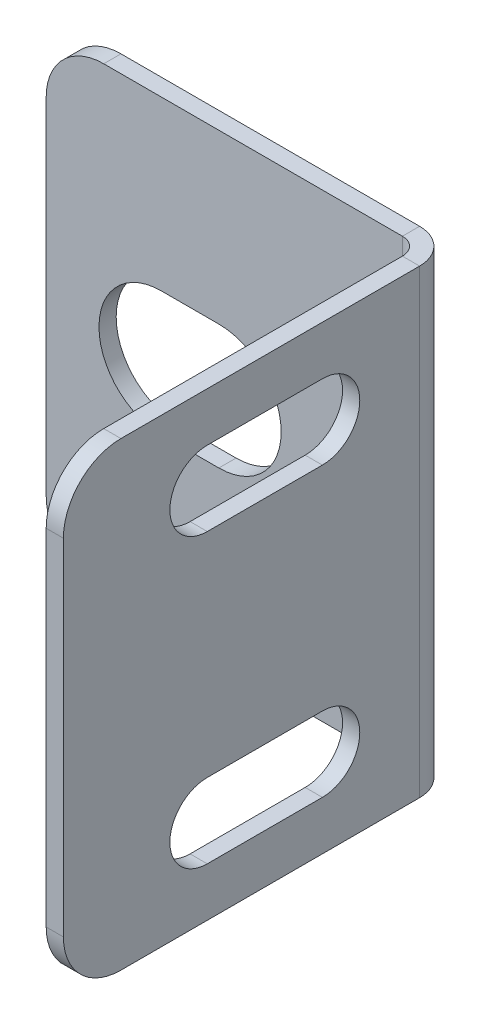
ISO-10303-21;
HEADER;
FILE_DESCRIPTION(('STEP AP214'),'2;1');
FILE_NAME('part.step','',(''),(''),'','','');
FILE_SCHEMA(('AUTOMOTIVE_DESIGN { 1 0 10303 214 1 1 1 1 }'));
ENDSEC;
DATA;
#1=APPLICATION_CONTEXT('core data for automotive mechanical design processes');
#2=APPLICATION_PROTOCOL_DEFINITION('international standard','automotive_design',2000,#1);
#3=PRODUCT_CONTEXT('',#1,'mechanical');
#4=PRODUCT('Part','Part','',(#3));
#5=PRODUCT_RELATED_PRODUCT_CATEGORY('part','',(#4));
#6=PRODUCT_DEFINITION_FORMATION('','',#4);
#7=PRODUCT_DEFINITION_CONTEXT('part definition',#1,'design');
#8=PRODUCT_DEFINITION('design','',#6,#7);
#9=PRODUCT_DEFINITION_SHAPE('','',#8);
#10=(LENGTH_UNIT() NAMED_UNIT(*) SI_UNIT(.MILLI.,.METRE.));
#11=(NAMED_UNIT(*) PLANE_ANGLE_UNIT() SI_UNIT($,.RADIAN.));
#12=(NAMED_UNIT(*) SI_UNIT($,.STERADIAN.) SOLID_ANGLE_UNIT());
#13=UNCERTAINTY_MEASURE_WITH_UNIT(LENGTH_MEASURE(1.E-05),#10,'distance_accuracy_value','');
#14=(GEOMETRIC_REPRESENTATION_CONTEXT(3) GLOBAL_UNCERTAINTY_ASSIGNED_CONTEXT((#13)) GLOBAL_UNIT_ASSIGNED_CONTEXT((#10,
#11,#12)) REPRESENTATION_CONTEXT('',''));
#15=CARTESIAN_POINT('',(0.,0.,0.));
#16=DIRECTION('',(0.,0.,1.));
#17=DIRECTION('',(1.,0.,0.));
#18=AXIS2_PLACEMENT_3D('',#15,#16,#17);
#19=CARTESIAN_POINT('',(-3.83615356006614,0.,4.54330643993387));
#20=DIRECTION('',(1.,0.,0.));
#21=DIRECTION('',(0.,0.,-1.));
#22=AXIS2_PLACEMENT_3D('',#19,#20,#21);
#23=PLANE('',#22);
#24=DIRECTION('',(0.,0.,1.));
#25=VECTOR('',#24,1.);
#26=CARTESIAN_POINT('',(-3.83615356006615,4.7,5.81330643993387));
#27=LINE('',#26,#25);
#28=CARTESIAN_POINT('',(-3.83615356006615,4.7,5.81330643993387));
#29=VERTEX_POINT('',#28);
#30=CARTESIAN_POINT('',(-3.83615356006616,4.7,10.8933064399339));
#31=VERTEX_POINT('',#30);
#32=EDGE_CURVE('E597',#29,#31,#27,.T.);
#33=ORIENTED_EDGE('',*,*,#32,.F.);
#34=CARTESIAN_POINT('',(-3.83615356006615,6.35,5.81330643993387));
#35=DIRECTION('',(-1.,0.,0.));
#36=DIRECTION('',(0.,0.,1.));
#37=AXIS2_PLACEMENT_3D('',#34,#35,#36);
#38=CIRCLE('',#37,1.65);
#39=CARTESIAN_POINT('',(-3.83615356006615,8.,5.81330643993387));
#40=VERTEX_POINT('',#39);
#41=EDGE_CURVE('E605',#40,#29,#38,.T.);
#42=ORIENTED_EDGE('',*,*,#41,.F.);
#43=DIRECTION('',(0.,0.,-1.));
#44=VECTOR('',#43,1.);
#45=CARTESIAN_POINT('',(-3.83615356006615,8.,5.81330643993387));
#46=LINE('',#45,#44);
#47=CARTESIAN_POINT('',(-3.83615356006616,8.,10.8933064399339));
#48=VERTEX_POINT('',#47);
#49=EDGE_CURVE('E736',#48,#40,#46,.T.);
#50=ORIENTED_EDGE('',*,*,#49,.F.);
#51=CARTESIAN_POINT('',(-3.83615356006616,6.35,10.8933064399339));
#52=DIRECTION('',(-1.,0.,0.));
#53=DIRECTION('',(0.,0.,1.));
#54=AXIS2_PLACEMENT_3D('',#51,#52,#53);
#55=CIRCLE('',#54,1.65);
#56=EDGE_CURVE('E512',#31,#48,#55,.T.);
#57=ORIENTED_EDGE('',*,*,#56,.F.);
#58=EDGE_LOOP('',(#33,#42,#50,#57));
#59=FACE_BOUND('',#58,.T.);
#60=DIRECTION('',(0.,0.,1.));
#61=VECTOR('',#60,1.);
#62=CARTESIAN_POINT('',(-3.83615356006614,-8.,5.81330643993386));
#63=LINE('',#62,#61);
#64=CARTESIAN_POINT('',(-3.83615356006614,-8.,5.81330643993386));
#65=VERTEX_POINT('',#64);
#66=CARTESIAN_POINT('',(-3.83615356006616,-8.,10.8933064399339));
#67=VERTEX_POINT('',#66);
#68=EDGE_CURVE('E538',#65,#67,#63,.T.);
#69=ORIENTED_EDGE('',*,*,#68,.F.);
#70=CARTESIAN_POINT('',(-3.83615356006614,-6.35,5.81330643993386));
#71=DIRECTION('',(-1.,0.,0.));
#72=DIRECTION('',(0.,0.,1.));
#73=AXIS2_PLACEMENT_3D('',#70,#71,#72);
#74=CIRCLE('',#73,1.65);
#75=CARTESIAN_POINT('',(-3.83615356006614,-4.7,5.81330643993387));
#76=VERTEX_POINT('',#75);
#77=EDGE_CURVE('E634',#76,#65,#74,.T.);
#78=ORIENTED_EDGE('',*,*,#77,.F.);
#79=DIRECTION('',(0.,0.,-1.));
#80=VECTOR('',#79,1.);
#81=CARTESIAN_POINT('',(-3.83615356006614,-4.7,5.81330643993387));
#82=LINE('',#81,#80);
#83=CARTESIAN_POINT('',(-3.83615356006616,-4.7,10.8933064399339));
#84=VERTEX_POINT('',#83);
#85=EDGE_CURVE('E598',#84,#76,#82,.T.);
#86=ORIENTED_EDGE('',*,*,#85,.F.);
#87=CARTESIAN_POINT('',(-3.83615356006616,-6.35,10.8933064399339));
#88=DIRECTION('',(-1.,0.,0.));
#89=DIRECTION('',(0.,0.,1.));
#90=AXIS2_PLACEMENT_3D('',#87,#88,#89);
#91=CIRCLE('',#90,1.65);
#92=EDGE_CURVE('E592',#67,#84,#91,.T.);
#93=ORIENTED_EDGE('',*,*,#92,.F.);
#94=EDGE_LOOP('',(#69,#78,#86,#93));
#95=FACE_BOUND('',#94,.T.);
#96=DIRECTION('',(0.,0.,-1.));
#97=VECTOR('',#96,1.);
#98=CARTESIAN_POINT('',(-3.83615356006619,10.16,17.2433064399339));
#99=LINE('',#98,#97);
#100=CARTESIAN_POINT('',(-3.83615356006618,10.16,14.7033064399339));
#101=VERTEX_POINT('',#100);
#102=CARTESIAN_POINT('',(-3.83615356006613,10.16,1.52146));
#103=VERTEX_POINT('',#102);
#104=EDGE_CURVE('E108',#101,#103,#99,.T.);
#105=ORIENTED_EDGE('',*,*,#104,.T.);
#106=DIRECTION('',(0.,-1.,0.));
#107=VECTOR('',#106,1.);
#108=CARTESIAN_POINT('',(-3.83615356006613,0.,1.52146));
#109=LINE('',#108,#107);
#110=CARTESIAN_POINT('',(-3.83615356006613,-10.16,1.52146));
#111=VERTEX_POINT('',#110);
#112=EDGE_CURVE('E340',#103,#111,#109,.T.);
#113=ORIENTED_EDGE('',*,*,#112,.T.);
#114=DIRECTION('',(0.,0.,1.));
#115=VECTOR('',#114,1.);
#116=CARTESIAN_POINT('',(-3.83615356006618,-10.16,17.2433064399339));
#117=LINE('',#116,#115);
#118=CARTESIAN_POINT('',(-3.83615356006618,-10.16,14.7033064399339));
#119=VERTEX_POINT('',#118);
#120=EDGE_CURVE('E505',#111,#119,#117,.T.);
#121=ORIENTED_EDGE('',*,*,#120,.T.);
#122=CARTESIAN_POINT('',(-3.83615356006618,-7.62,14.7033064399339));
#123=DIRECTION('',(1.,0.,0.));
#124=DIRECTION('',(0.,0.,-1.));
#125=AXIS2_PLACEMENT_3D('',#122,#123,#124);
#126=CIRCLE('',#125,2.54);
#127=CARTESIAN_POINT('',(-3.83615356006618,-7.62,17.2433064399339));
#128=VERTEX_POINT('',#127);
#129=EDGE_CURVE('E682',#119,#128,#126,.F.);
#130=ORIENTED_EDGE('',*,*,#129,.T.);
#131=DIRECTION('',(0.,1.,0.));
#132=VECTOR('',#131,1.);
#133=CARTESIAN_POINT('',(-3.83615356006619,10.16,17.2433064399339));
#134=LINE('',#133,#132);
#135=CARTESIAN_POINT('',(-3.83615356006619,7.62,17.2433064399339));
#136=VERTEX_POINT('',#135);
#137=EDGE_CURVE('E511',#128,#136,#134,.T.);
#138=ORIENTED_EDGE('',*,*,#137,.T.);
#139=CARTESIAN_POINT('',(-3.83615356006618,7.62,14.7033064399339));
#140=DIRECTION('',(1.,0.,0.));
#141=DIRECTION('',(0.,0.,-1.));
#142=AXIS2_PLACEMENT_3D('',#139,#140,#141);
#143=CIRCLE('',#142,2.54);
#144=EDGE_CURVE('E685',#136,#101,#143,.F.);
#145=ORIENTED_EDGE('',*,*,#144,.T.);
#146=EDGE_LOOP('',(#105,#113,#121,#130,#138,#145));
#147=FACE_BOUND('',#146,.T.);
#148=ADVANCED_FACE('F103',(#59,#95,#147),#23,.F.);
#149=CARTESIAN_POINT('',(-3.83615356006619,10.16,17.2433064399339));
#150=DIRECTION('',(0.,0.,-1.));
#151=DIRECTION('',(0.,1.,0.));
#152=AXIS2_PLACEMENT_3D('',#149,#150,#151);
#153=PLANE('',#152);
#154=DIRECTION('',(0.,1.,0.));
#155=VECTOR('',#154,1.);
#156=CARTESIAN_POINT('',(-3.07669356006619,0.,17.2433064399339));
#157=LINE('',#156,#155);
#158=CARTESIAN_POINT('',(-3.07669356006618,-7.62,17.2433064399339));
#159=VERTEX_POINT('',#158);
#160=CARTESIAN_POINT('',(-3.07669356006619,7.62,17.2433064399339));
#161=VERTEX_POINT('',#160);
#162=EDGE_CURVE('E539',#159,#161,#157,.T.);
#163=ORIENTED_EDGE('',*,*,#162,.T.);
#164=DIRECTION('',(1.,0.,0.));
#165=VECTOR('',#164,1.);
#166=CARTESIAN_POINT('',(-3.83615356006619,7.62,17.2433064399339));
#167=LINE('',#166,#165);
#168=EDGE_CURVE('E678',#161,#136,#167,.F.);
#169=ORIENTED_EDGE('',*,*,#168,.T.);
#170=ORIENTED_EDGE('',*,*,#137,.F.);
#171=DIRECTION('',(1.,0.,0.));
#172=VECTOR('',#171,1.);
#173=CARTESIAN_POINT('',(-3.83615356006618,-7.62,17.2433064399339));
#174=LINE('',#173,#172);
#175=EDGE_CURVE('E672',#128,#159,#174,.T.);
#176=ORIENTED_EDGE('',*,*,#175,.T.);
#177=EDGE_LOOP('',(#163,#169,#170,#176));
#178=FACE_BOUND('',#177,.T.);
#179=ADVANCED_FACE('F705',(#178),#153,.F.);
#180=CARTESIAN_POINT('',(-3.83615356006619,10.16,17.2433064399339));
#181=DIRECTION('',(0.,-1.,0.));
#182=DIRECTION('',(0.,0.,-1.));
#183=AXIS2_PLACEMENT_3D('',#180,#181,#182);
#184=PLANE('',#183);
#185=DIRECTION('',(1.,0.,0.));
#186=VECTOR('',#185,1.);
#187=CARTESIAN_POINT('',(-3.83615356006613,10.16,1.52146));
#188=LINE('',#187,#186);
#189=CARTESIAN_POINT('',(-3.07669356006613,10.16,1.52146000000001));
#190=VERTEX_POINT('',#189);
#191=EDGE_CURVE('E515',#103,#190,#188,.T.);
#192=ORIENTED_EDGE('',*,*,#191,.F.);
#193=ORIENTED_EDGE('',*,*,#104,.F.);
#194=DIRECTION('',(1.,0.,0.));
#195=VECTOR('',#194,1.);
#196=CARTESIAN_POINT('',(-3.83615356006618,10.16,14.7033064399339));
#197=LINE('',#196,#195);
#198=CARTESIAN_POINT('',(-3.07669356006618,10.16,14.7033064399339));
#199=VERTEX_POINT('',#198);
#200=EDGE_CURVE('E687',#101,#199,#197,.T.);
#201=ORIENTED_EDGE('',*,*,#200,.T.);
#202=DIRECTION('',(0.,0.,-1.));
#203=VECTOR('',#202,1.);
#204=CARTESIAN_POINT('',(-3.07669356006614,10.16,4.54330643993387));
#205=LINE('',#204,#203);
#206=EDGE_CURVE('E137',#199,#190,#205,.T.);
#207=ORIENTED_EDGE('',*,*,#206,.T.);
#208=EDGE_LOOP('',(#192,#193,#201,#207));
#209=FACE_BOUND('',#208,.T.);
#210=ADVANCED_FACE('F711',(#209),#184,.F.);
#211=CARTESIAN_POINT('',(-3.83615356006615,8.,5.81330643993387));
#212=DIRECTION('',(0.,-1.,0.));
#213=DIRECTION('',(0.,0.,-1.));
#214=AXIS2_PLACEMENT_3D('',#211,#212,#213);
#215=PLANE('',#214);
#216=DIRECTION('',(-1.,0.,0.));
#217=VECTOR('',#216,1.);
#218=CARTESIAN_POINT('',(-3.83615356006615,8.,5.81330643993387));
#219=LINE('',#218,#217);
#220=CARTESIAN_POINT('',(-3.07669356006615,8.,5.81330643993387));
#221=VERTEX_POINT('',#220);
#222=EDGE_CURVE('E667',#221,#40,#219,.T.);
#223=ORIENTED_EDGE('',*,*,#222,.F.);
#224=DIRECTION('',(0.,0.,-1.));
#225=VECTOR('',#224,1.);
#226=CARTESIAN_POINT('',(-3.07669356006614,8.,4.54330643993387));
#227=LINE('',#226,#225);
#228=CARTESIAN_POINT('',(-3.07669356006617,8.,10.8933064399339));
#229=VERTEX_POINT('',#228);
#230=EDGE_CURVE('E650',#229,#221,#227,.T.);
#231=ORIENTED_EDGE('',*,*,#230,.F.);
#232=DIRECTION('',(-1.,0.,0.));
#233=VECTOR('',#232,1.);
#234=CARTESIAN_POINT('',(-3.83615356006616,8.,10.8933064399339));
#235=LINE('',#234,#233);
#236=EDGE_CURVE('E661',#229,#48,#235,.T.);
#237=ORIENTED_EDGE('',*,*,#236,.T.);
#238=ORIENTED_EDGE('',*,*,#49,.T.);
#239=EDGE_LOOP('',(#223,#231,#237,#238));
#240=FACE_BOUND('',#239,.T.);
#241=ADVANCED_FACE('F743',(#240),#215,.T.);
#242=CARTESIAN_POINT('',(-3.83615356006616,6.35,10.8933064399339));
#243=DIRECTION('',(-1.,0.,0.));
#244=DIRECTION('',(0.,0.,1.));
#245=AXIS2_PLACEMENT_3D('',#242,#243,#244);
#246=CYLINDRICAL_SURFACE('',#245,1.65);
#247=ORIENTED_EDGE('',*,*,#236,.F.);
#248=CARTESIAN_POINT('',(-3.07669356006617,6.35,10.8933064399339));
#249=DIRECTION('',(-1.,0.,0.));
#250=DIRECTION('',(0.,0.,1.));
#251=AXIS2_PLACEMENT_3D('',#248,#249,#250);
#252=CIRCLE('',#251,1.65);
#253=CARTESIAN_POINT('',(-3.07669356006616,4.7,10.8933064399339));
#254=VERTEX_POINT('',#253);
#255=EDGE_CURVE('E645',#254,#229,#252,.T.);
#256=ORIENTED_EDGE('',*,*,#255,.F.);
#257=DIRECTION('',(-1.,0.,0.));
#258=VECTOR('',#257,1.);
#259=CARTESIAN_POINT('',(-3.83615356006616,4.7,10.8933064399339));
#260=LINE('',#259,#258);
#261=EDGE_CURVE('E657',#254,#31,#260,.T.);
#262=ORIENTED_EDGE('',*,*,#261,.T.);
#263=ORIENTED_EDGE('',*,*,#56,.T.);
#264=EDGE_LOOP('',(#247,#256,#262,#263));
#265=FACE_BOUND('',#264,.T.);
#266=ADVANCED_FACE('F744',(#265),#246,.F.);
#267=CARTESIAN_POINT('',(-3.83615356006615,4.7,5.81330643993387));
#268=DIRECTION('',(0.,1.,0.));
#269=DIRECTION('',(0.,0.,1.));
#270=AXIS2_PLACEMENT_3D('',#267,#268,#269);
#271=PLANE('',#270);
#272=ORIENTED_EDGE('',*,*,#261,.F.);
#273=DIRECTION('',(0.,0.,-1.));
#274=VECTOR('',#273,1.);
#275=CARTESIAN_POINT('',(-3.07669356006614,4.7,4.54330643993387));
#276=LINE('',#275,#274);
#277=CARTESIAN_POINT('',(-3.07669356006615,4.7,5.81330643993387));
#278=VERTEX_POINT('',#277);
#279=EDGE_CURVE('E581',#278,#254,#276,.F.);
#280=ORIENTED_EDGE('',*,*,#279,.F.);
#281=DIRECTION('',(-1.,0.,0.));
#282=VECTOR('',#281,1.);
#283=CARTESIAN_POINT('',(-3.83615356006615,4.7,5.81330643993387));
#284=LINE('',#283,#282);
#285=EDGE_CURVE('E662',#278,#29,#284,.T.);
#286=ORIENTED_EDGE('',*,*,#285,.T.);
#287=ORIENTED_EDGE('',*,*,#32,.T.);
#288=EDGE_LOOP('',(#272,#280,#286,#287));
#289=FACE_BOUND('',#288,.T.);
#290=ADVANCED_FACE('F729',(#289),#271,.T.);
#291=CARTESIAN_POINT('',(-3.83615356006614,-4.7,5.81330643993387));
#292=DIRECTION('',(0.,-1.,0.));
#293=DIRECTION('',(0.,0.,-1.));
#294=AXIS2_PLACEMENT_3D('',#291,#292,#293);
#295=PLANE('',#294);
#296=DIRECTION('',(-1.,0.,0.));
#297=VECTOR('',#296,1.);
#298=CARTESIAN_POINT('',(-3.83615356006614,-4.7,5.81330643993387));
#299=LINE('',#298,#297);
#300=CARTESIAN_POINT('',(-3.07669356006615,-4.7,5.81330643993387));
#301=VERTEX_POINT('',#300);
#302=EDGE_CURVE('E627',#301,#76,#299,.T.);
#303=ORIENTED_EDGE('',*,*,#302,.F.);
#304=DIRECTION('',(0.,0.,-1.));
#305=VECTOR('',#304,1.);
#306=CARTESIAN_POINT('',(-3.07669356006614,-4.7,4.54330643993387));
#307=LINE('',#306,#305);
#308=CARTESIAN_POINT('',(-3.07669356006616,-4.7,10.8933064399339));
#309=VERTEX_POINT('',#308);
#310=EDGE_CURVE('E572',#309,#301,#307,.T.);
#311=ORIENTED_EDGE('',*,*,#310,.F.);
#312=DIRECTION('',(-1.,0.,0.));
#313=VECTOR('',#312,1.);
#314=CARTESIAN_POINT('',(-3.83615356006616,-4.7,10.8933064399339));
#315=LINE('',#314,#313);
#316=EDGE_CURVE('E621',#309,#84,#315,.T.);
#317=ORIENTED_EDGE('',*,*,#316,.T.);
#318=ORIENTED_EDGE('',*,*,#85,.T.);
#319=EDGE_LOOP('',(#303,#311,#317,#318));
#320=FACE_BOUND('',#319,.T.);
#321=ADVANCED_FACE('F751',(#320),#295,.T.);
#322=CARTESIAN_POINT('',(-3.83615356006616,-6.35,10.8933064399339));
#323=DIRECTION('',(-1.,0.,0.));
#324=DIRECTION('',(0.,0.,1.));
#325=AXIS2_PLACEMENT_3D('',#322,#323,#324);
#326=CYLINDRICAL_SURFACE('',#325,1.65);
#327=ORIENTED_EDGE('',*,*,#316,.F.);
#328=CARTESIAN_POINT('',(-3.07669356006616,-6.35,10.8933064399339));
#329=DIRECTION('',(-1.,0.,0.));
#330=DIRECTION('',(0.,0.,1.));
#331=AXIS2_PLACEMENT_3D('',#328,#329,#330);
#332=CIRCLE('',#331,1.65);
#333=CARTESIAN_POINT('',(-3.07669356006616,-8.,10.8933064399339));
#334=VERTEX_POINT('',#333);
#335=EDGE_CURVE('E577',#334,#309,#332,.T.);
#336=ORIENTED_EDGE('',*,*,#335,.F.);
#337=DIRECTION('',(-1.,0.,0.));
#338=VECTOR('',#337,1.);
#339=CARTESIAN_POINT('',(-3.83615356006616,-8.,10.8933064399339));
#340=LINE('',#339,#338);
#341=EDGE_CURVE('E617',#334,#67,#340,.T.);
#342=ORIENTED_EDGE('',*,*,#341,.T.);
#343=ORIENTED_EDGE('',*,*,#92,.T.);
#344=EDGE_LOOP('',(#327,#336,#342,#343));
#345=FACE_BOUND('',#344,.T.);
#346=ADVANCED_FACE('F836',(#345),#326,.F.);
#347=CARTESIAN_POINT('',(-3.83615356006614,-8.,5.81330643993386));
#348=DIRECTION('',(0.,1.,0.));
#349=DIRECTION('',(0.,0.,1.));
#350=AXIS2_PLACEMENT_3D('',#347,#348,#349);
#351=PLANE('',#350);
#352=ORIENTED_EDGE('',*,*,#341,.F.);
#353=DIRECTION('',(0.,0.,-1.));
#354=VECTOR('',#353,1.);
#355=CARTESIAN_POINT('',(-3.07669356006614,-8.,4.54330643993387));
#356=LINE('',#355,#354);
#357=CARTESIAN_POINT('',(-3.07669356006614,-8.,5.81330643993387));
#358=VERTEX_POINT('',#357);
#359=EDGE_CURVE('E559',#358,#334,#356,.F.);
#360=ORIENTED_EDGE('',*,*,#359,.F.);
#361=DIRECTION('',(-1.,0.,0.));
#362=VECTOR('',#361,1.);
#363=CARTESIAN_POINT('',(-3.83615356006614,-8.,5.81330643993386));
#364=LINE('',#363,#362);
#365=EDGE_CURVE('E622',#358,#65,#364,.T.);
#366=ORIENTED_EDGE('',*,*,#365,.T.);
#367=ORIENTED_EDGE('',*,*,#68,.T.);
#368=EDGE_LOOP('',(#352,#360,#366,#367));
#369=FACE_BOUND('',#368,.T.);
#370=ADVANCED_FACE('F786',(#369),#351,.T.);
#371=CARTESIAN_POINT('',(-3.83615356006614,-6.35,5.81330643993386));
#372=DIRECTION('',(-1.,0.,0.));
#373=DIRECTION('',(0.,0.,1.));
#374=AXIS2_PLACEMENT_3D('',#371,#372,#373);
#375=CYLINDRICAL_SURFACE('',#374,1.65);
#376=CARTESIAN_POINT('',(-3.07669356006615,-6.35,5.81330643993387));
#377=DIRECTION('',(-1.,0.,0.));
#378=DIRECTION('',(0.,0.,1.));
#379=AXIS2_PLACEMENT_3D('',#376,#377,#378);
#380=CIRCLE('',#379,1.65);
#381=EDGE_CURVE('E562',#301,#358,#380,.T.);
#382=ORIENTED_EDGE('',*,*,#381,.F.);
#383=ORIENTED_EDGE('',*,*,#302,.T.);
#384=ORIENTED_EDGE('',*,*,#77,.T.);
#385=ORIENTED_EDGE('',*,*,#365,.F.);
#386=EDGE_LOOP('',(#382,#383,#384,#385));
#387=FACE_BOUND('',#386,.T.);
#388=ADVANCED_FACE('F781',(#387),#375,.F.);
#389=CARTESIAN_POINT('',(-3.83615356006615,6.35,5.81330643993387));
#390=DIRECTION('',(-1.,0.,0.));
#391=DIRECTION('',(0.,0.,1.));
#392=AXIS2_PLACEMENT_3D('',#389,#390,#391);
#393=CYLINDRICAL_SURFACE('',#392,1.65);
#394=CARTESIAN_POINT('',(-3.07669356006615,6.35,5.81330643993387));
#395=DIRECTION('',(-1.,0.,0.));
#396=DIRECTION('',(0.,0.,1.));
#397=AXIS2_PLACEMENT_3D('',#394,#395,#396);
#398=CIRCLE('',#397,1.65);
#399=EDGE_CURVE('E644',#221,#278,#398,.T.);
#400=ORIENTED_EDGE('',*,*,#399,.F.);
#401=ORIENTED_EDGE('',*,*,#222,.T.);
#402=ORIENTED_EDGE('',*,*,#41,.T.);
#403=ORIENTED_EDGE('',*,*,#285,.F.);
#404=EDGE_LOOP('',(#400,#401,#402,#403));
#405=FACE_BOUND('',#404,.T.);
#406=ADVANCED_FACE('F724',(#405),#393,.F.);
#407=CARTESIAN_POINT('',(-3.83615356006618,-10.16,17.2433064399339));
#408=DIRECTION('',(0.,1.,0.));
#409=DIRECTION('',(0.,0.,1.));
#410=AXIS2_PLACEMENT_3D('',#407,#408,#409);
#411=PLANE('',#410);
#412=DIRECTION('',(-1.,0.,0.));
#413=VECTOR('',#412,1.);
#414=CARTESIAN_POINT('',(-3.83615356006613,-10.16,1.52146));
#415=LINE('',#414,#413);
#416=CARTESIAN_POINT('',(-3.07669356006613,-10.16,1.52146));
#417=VERTEX_POINT('',#416);
#418=EDGE_CURVE('E13',#417,#111,#415,.T.);
#419=ORIENTED_EDGE('',*,*,#418,.F.);
#420=DIRECTION('',(0.,0.,-1.));
#421=VECTOR('',#420,1.);
#422=CARTESIAN_POINT('',(-3.07669356006614,-10.16,4.54330643993387));
#423=LINE('',#422,#421);
#424=CARTESIAN_POINT('',(-3.07669356006618,-10.16,14.7033064399339));
#425=VERTEX_POINT('',#424);
#426=EDGE_CURVE('E126',#417,#425,#423,.F.);
#427=ORIENTED_EDGE('',*,*,#426,.T.);
#428=DIRECTION('',(1.,0.,0.));
#429=VECTOR('',#428,1.);
#430=CARTESIAN_POINT('',(-3.83615356006618,-10.16,14.7033064399339));
#431=LINE('',#430,#429);
#432=EDGE_CURVE('E507',#425,#119,#431,.F.);
#433=ORIENTED_EDGE('',*,*,#432,.T.);
#434=ORIENTED_EDGE('',*,*,#120,.F.);
#435=EDGE_LOOP('',(#419,#427,#433,#434));
#436=FACE_BOUND('',#435,.T.);
#437=ADVANCED_FACE('F106',(#436),#411,.F.);
#438=CARTESIAN_POINT('',(-3.07669356006614,0.,4.54330643993387));
#439=DIRECTION('',(1.,0.,0.));
#440=DIRECTION('',(0.,0.,-1.));
#441=AXIS2_PLACEMENT_3D('',#438,#439,#440);
#442=PLANE('',#441);
#443=DIRECTION('',(0.,-1.,0.));
#444=VECTOR('',#443,1.);
#445=CARTESIAN_POINT('',(-3.07669356006613,0.,1.52146));
#446=LINE('',#445,#444);
#447=EDGE_CURVE('E115',#190,#417,#446,.T.);
#448=ORIENTED_EDGE('',*,*,#447,.F.);
#449=ORIENTED_EDGE('',*,*,#206,.F.);
#450=CARTESIAN_POINT('',(-3.07669356006618,7.62,14.7033064399339));
#451=DIRECTION('',(1.,0.,0.));
#452=DIRECTION('',(0.,0.,-1.));
#453=AXIS2_PLACEMENT_3D('',#450,#451,#452);
#454=CIRCLE('',#453,2.54);
#455=EDGE_CURVE('E520',#199,#161,#454,.T.);
#456=ORIENTED_EDGE('',*,*,#455,.T.);
#457=ORIENTED_EDGE('',*,*,#162,.F.);
#458=CARTESIAN_POINT('',(-3.07669356006618,-7.62,14.7033064399339));
#459=DIRECTION('',(1.,0.,0.));
#460=DIRECTION('',(0.,0.,-1.));
#461=AXIS2_PLACEMENT_3D('',#458,#459,#460);
#462=CIRCLE('',#461,2.54);
#463=EDGE_CURVE('E691',#159,#425,#462,.T.);
#464=ORIENTED_EDGE('',*,*,#463,.T.);
#465=ORIENTED_EDGE('',*,*,#426,.F.);
#466=EDGE_LOOP('',(#448,#449,#456,#457,#464,#465));
#467=FACE_BOUND('',#466,.T.);
#468=ORIENTED_EDGE('',*,*,#359,.T.);
#469=ORIENTED_EDGE('',*,*,#335,.T.);
#470=ORIENTED_EDGE('',*,*,#310,.T.);
#471=ORIENTED_EDGE('',*,*,#381,.T.);
#472=EDGE_LOOP('',(#468,#469,#470,#471));
#473=FACE_BOUND('',#472,.T.);
#474=ORIENTED_EDGE('',*,*,#279,.T.);
#475=ORIENTED_EDGE('',*,*,#255,.T.);
#476=ORIENTED_EDGE('',*,*,#230,.T.);
#477=ORIENTED_EDGE('',*,*,#399,.T.);
#478=EDGE_LOOP('',(#474,#475,#476,#477));
#479=FACE_BOUND('',#478,.T.);
#480=ADVANCED_FACE('F699',(#467,#473,#479),#442,.T.);
#481=CARTESIAN_POINT('',(-3.83615356006618,7.62,14.7033064399339));
#482=DIRECTION('',(-1.,0.,0.));
#483=DIRECTION('',(0.,0.,1.));
#484=AXIS2_PLACEMENT_3D('',#481,#482,#483);
#485=CYLINDRICAL_SURFACE('',#484,2.54);
#486=ORIENTED_EDGE('',*,*,#455,.F.);
#487=ORIENTED_EDGE('',*,*,#200,.F.);
#488=ORIENTED_EDGE('',*,*,#144,.F.);
#489=ORIENTED_EDGE('',*,*,#168,.F.);
#490=EDGE_LOOP('',(#486,#487,#488,#489));
#491=FACE_BOUND('',#490,.T.);
#492=ADVANCED_FACE('F710',(#491),#485,.T.);
#493=CARTESIAN_POINT('',(-3.83615356006618,-7.62,14.7033064399339));
#494=DIRECTION('',(-1.,0.,0.));
#495=DIRECTION('',(0.,0.,1.));
#496=AXIS2_PLACEMENT_3D('',#493,#494,#495);
#497=CYLINDRICAL_SURFACE('',#496,2.54);
#498=ORIENTED_EDGE('',*,*,#463,.F.);
#499=ORIENTED_EDGE('',*,*,#175,.F.);
#500=ORIENTED_EDGE('',*,*,#129,.F.);
#501=ORIENTED_EDGE('',*,*,#432,.F.);
#502=EDGE_LOOP('',(#498,#499,#500,#501));
#503=FACE_BOUND('',#502,.T.);
#504=ADVANCED_FACE('F767',(#503),#497,.T.);
#505=CARTESIAN_POINT('',(-12.7,0.,0.75946));
#506=DIRECTION('',(0.,0.,1.));
#507=DIRECTION('',(1.,0.,0.));
#508=AXIS2_PLACEMENT_3D('',#505,#506,#507);
#509=CYLINDRICAL_SURFACE('',#508,2.75);
#510=DIRECTION('',(0.,0.,1.));
#511=VECTOR('',#510,1.);
#512=CARTESIAN_POINT('',(-12.7,2.75,0.75946));
#513=LINE('',#512,#511);
#514=CARTESIAN_POINT('',(-12.7,2.75,0.));
#515=VERTEX_POINT('',#514);
#516=CARTESIAN_POINT('',(-12.7,2.75,0.75946));
#517=VERTEX_POINT('',#516);
#518=EDGE_CURVE('E448',#515,#517,#513,.T.);
#519=ORIENTED_EDGE('',*,*,#518,.F.);
#520=CARTESIAN_POINT('',(-12.7,0.,0.));
#521=DIRECTION('',(0.,0.,1.));
#522=DIRECTION('',(1.,0.,0.));
#523=AXIS2_PLACEMENT_3D('',#520,#521,#522);
#524=CIRCLE('',#523,2.75);
#525=CARTESIAN_POINT('',(-12.7,-2.75,0.));
#526=VERTEX_POINT('',#525);
#527=EDGE_CURVE('E432',#526,#515,#524,.T.);
#528=ORIENTED_EDGE('',*,*,#527,.F.);
#529=DIRECTION('',(0.,0.,1.));
#530=VECTOR('',#529,1.);
#531=CARTESIAN_POINT('',(-12.7,-2.75,0.75946));
#532=LINE('',#531,#530);
#533=CARTESIAN_POINT('',(-12.7,-2.75,0.75946));
#534=VERTEX_POINT('',#533);
#535=EDGE_CURVE('E354',#526,#534,#532,.T.);
#536=ORIENTED_EDGE('',*,*,#535,.T.);
#537=CARTESIAN_POINT('',(-12.7,0.,0.75946));
#538=DIRECTION('',(0.,0.,1.));
#539=DIRECTION('',(1.,0.,0.));
#540=AXIS2_PLACEMENT_3D('',#537,#538,#539);
#541=CIRCLE('',#540,2.75);
#542=EDGE_CURVE('E455',#534,#517,#541,.T.);
#543=ORIENTED_EDGE('',*,*,#542,.T.);
#544=EDGE_LOOP('',(#519,#528,#536,#543));
#545=FACE_BOUND('',#544,.T.);
#546=ADVANCED_FACE('F814',(#545),#509,.F.);
#547=CARTESIAN_POINT('',(-15.24,2.75,0.75946));
#548=DIRECTION('',(0.,-1.,0.));
#549=DIRECTION('',(-1.,0.,0.));
#550=AXIS2_PLACEMENT_3D('',#547,#548,#549);
#551=PLANE('',#550);
#552=DIRECTION('',(0.,0.,1.));
#553=VECTOR('',#552,1.);
#554=CARTESIAN_POINT('',(-15.24,2.75,0.75946));
#555=LINE('',#554,#553);
#556=CARTESIAN_POINT('',(-15.24,2.75,0.));
#557=VERTEX_POINT('',#556);
#558=CARTESIAN_POINT('',(-15.24,2.75,0.75946));
#559=VERTEX_POINT('',#558);
#560=EDGE_CURVE('E439',#557,#559,#555,.T.);
#561=ORIENTED_EDGE('',*,*,#560,.F.);
#562=DIRECTION('',(-1.,0.,0.));
#563=VECTOR('',#562,1.);
#564=CARTESIAN_POINT('',(0.,2.75,0.));
#565=LINE('',#564,#563);
#566=EDGE_CURVE('E425',#515,#557,#565,.T.);
#567=ORIENTED_EDGE('',*,*,#566,.F.);
#568=ORIENTED_EDGE('',*,*,#518,.T.);
#569=DIRECTION('',(-1.,0.,0.));
#570=VECTOR('',#569,1.);
#571=CARTESIAN_POINT('',(-15.24,2.75,0.75946));
#572=LINE('',#571,#570);
#573=EDGE_CURVE('E443',#517,#559,#572,.T.);
#574=ORIENTED_EDGE('',*,*,#573,.T.);
#575=EDGE_LOOP('',(#561,#567,#568,#574));
#576=FACE_BOUND('',#575,.T.);
#577=ADVANCED_FACE('F819',(#576),#551,.T.);
#578=CARTESIAN_POINT('',(-15.24,0.,0.75946));
#579=DIRECTION('',(0.,0.,1.));
#580=DIRECTION('',(1.,0.,0.));
#581=AXIS2_PLACEMENT_3D('',#578,#579,#580);
#582=CYLINDRICAL_SURFACE('',#581,2.75);
#583=CARTESIAN_POINT('',(-15.24,0.,0.));
#584=DIRECTION('',(0.,0.,1.));
#585=DIRECTION('',(1.,0.,0.));
#586=AXIS2_PLACEMENT_3D('',#583,#584,#585);
#587=CIRCLE('',#586,2.75);
#588=CARTESIAN_POINT('',(-15.24,-2.75,0.));
#589=VERTEX_POINT('',#588);
#590=EDGE_CURVE('E418',#557,#589,#587,.T.);
#591=ORIENTED_EDGE('',*,*,#590,.F.);
#592=ORIENTED_EDGE('',*,*,#560,.T.);
#593=CARTESIAN_POINT('',(-15.24,0.,0.75946));
#594=DIRECTION('',(0.,0.,1.));
#595=DIRECTION('',(1.,0.,0.));
#596=AXIS2_PLACEMENT_3D('',#593,#594,#595);
#597=CIRCLE('',#596,2.75);
#598=CARTESIAN_POINT('',(-15.24,-2.75,0.75946));
#599=VERTEX_POINT('',#598);
#600=EDGE_CURVE('E409',#559,#599,#597,.T.);
#601=ORIENTED_EDGE('',*,*,#600,.T.);
#602=DIRECTION('',(0.,0.,1.));
#603=VECTOR('',#602,1.);
#604=CARTESIAN_POINT('',(-15.24,-2.75,0.75946));
#605=LINE('',#604,#603);
#606=EDGE_CURVE('E406',#589,#599,#605,.T.);
#607=ORIENTED_EDGE('',*,*,#606,.F.);
#608=EDGE_LOOP('',(#591,#592,#601,#607));
#609=FACE_BOUND('',#608,.T.);
#610=ADVANCED_FACE('F828',(#609),#582,.F.);
#611=CARTESIAN_POINT('',(-15.24,-2.75,0.75946));
#612=DIRECTION('',(0.,1.,0.));
#613=DIRECTION('',(1.,0.,0.));
#614=AXIS2_PLACEMENT_3D('',#611,#612,#613);
#615=PLANE('',#614);
#616=ORIENTED_EDGE('',*,*,#535,.F.);
#617=DIRECTION('',(-1.,0.,0.));
#618=VECTOR('',#617,1.);
#619=CARTESIAN_POINT('',(0.,-2.75,0.));
#620=LINE('',#619,#618);
#621=EDGE_CURVE('E859',#589,#526,#620,.F.);
#622=ORIENTED_EDGE('',*,*,#621,.F.);
#623=ORIENTED_EDGE('',*,*,#606,.T.);
#624=DIRECTION('',(1.,0.,0.));
#625=VECTOR('',#624,1.);
#626=CARTESIAN_POINT('',(-15.24,-2.75,0.75946));
#627=LINE('',#626,#625);
#628=EDGE_CURVE('E399',#599,#534,#627,.T.);
#629=ORIENTED_EDGE('',*,*,#628,.T.);
#630=EDGE_LOOP('',(#616,#622,#623,#629));
#631=FACE_BOUND('',#630,.T.);
#632=ADVANCED_FACE('F823',(#631),#615,.T.);
#633=CARTESIAN_POINT('',(-17.78,-7.62,0.75946));
#634=DIRECTION('',(0.,0.,1.));
#635=DIRECTION('',(1.,0.,0.));
#636=AXIS2_PLACEMENT_3D('',#633,#634,#635);
#637=CYLINDRICAL_SURFACE('',#636,2.54);
#638=CARTESIAN_POINT('',(-17.78,-7.62,0.));
#639=DIRECTION('',(0.,0.,-1.));
#640=DIRECTION('',(-1.,0.,0.));
#641=AXIS2_PLACEMENT_3D('',#638,#639,#640);
#642=CIRCLE('',#641,2.54);
#643=CARTESIAN_POINT('',(-17.78,-10.16,0.));
#644=VERTEX_POINT('',#643);
#645=CARTESIAN_POINT('',(-20.32,-7.62,0.));
#646=VERTEX_POINT('',#645);
#647=EDGE_CURVE('E484',#644,#646,#642,.T.);
#648=ORIENTED_EDGE('',*,*,#647,.F.);
#649=DIRECTION('',(0.,0.,-1.));
#650=VECTOR('',#649,1.);
#651=CARTESIAN_POINT('',(-17.78,-10.16,0.75946));
#652=LINE('',#651,#650);
#653=CARTESIAN_POINT('',(-17.78,-10.16,0.75946));
#654=VERTEX_POINT('',#653);
#655=EDGE_CURVE('E474',#654,#644,#652,.T.);
#656=ORIENTED_EDGE('',*,*,#655,.F.);
#657=CARTESIAN_POINT('',(-17.78,-7.62,0.75946));
#658=DIRECTION('',(0.,0.,-1.));
#659=DIRECTION('',(-1.,0.,0.));
#660=AXIS2_PLACEMENT_3D('',#657,#658,#659);
#661=CIRCLE('',#660,2.54);
#662=CARTESIAN_POINT('',(-20.32,-7.62,0.75946));
#663=VERTEX_POINT('',#662);
#664=EDGE_CURVE('E390',#663,#654,#661,.F.);
#665=ORIENTED_EDGE('',*,*,#664,.F.);
#666=DIRECTION('',(0.,0.,-1.));
#667=VECTOR('',#666,1.);
#668=CARTESIAN_POINT('',(-20.32,-7.62,0.75946));
#669=LINE('',#668,#667);
#670=EDGE_CURVE('E369',#646,#663,#669,.F.);
#671=ORIENTED_EDGE('',*,*,#670,.F.);
#672=EDGE_LOOP('',(#648,#656,#665,#671));
#673=FACE_BOUND('',#672,.T.);
#674=ADVANCED_FACE('F557',(#673),#637,.T.);
#675=CARTESIAN_POINT('',(-20.32,10.16,0.75946));
#676=DIRECTION('',(1.,0.,0.));
#677=DIRECTION('',(0.,-1.,0.));
#678=AXIS2_PLACEMENT_3D('',#675,#676,#677);
#679=PLANE('',#678);
#680=DIRECTION('',(0.,1.,0.));
#681=VECTOR('',#680,1.);
#682=CARTESIAN_POINT('',(-20.32,0.,0.));
#683=LINE('',#682,#681);
#684=CARTESIAN_POINT('',(-20.32,7.62,0.));
#685=VERTEX_POINT('',#684);
#686=EDGE_CURVE('E405',#685,#646,#683,.F.);
#687=ORIENTED_EDGE('',*,*,#686,.T.);
#688=ORIENTED_EDGE('',*,*,#670,.T.);
#689=DIRECTION('',(0.,-1.,0.));
#690=VECTOR('',#689,1.);
#691=CARTESIAN_POINT('',(-20.32,10.16,0.75946));
#692=LINE('',#691,#690);
#693=CARTESIAN_POINT('',(-20.32,7.62,0.75946));
#694=VERTEX_POINT('',#693);
#695=EDGE_CURVE('E366',#694,#663,#692,.T.);
#696=ORIENTED_EDGE('',*,*,#695,.F.);
#697=DIRECTION('',(0.,0.,-1.));
#698=VECTOR('',#697,1.);
#699=CARTESIAN_POINT('',(-20.32,7.62,0.75946));
#700=LINE('',#699,#698);
#701=EDGE_CURVE('E362',#694,#685,#700,.T.);
#702=ORIENTED_EDGE('',*,*,#701,.T.);
#703=EDGE_LOOP('',(#687,#688,#696,#702));
#704=FACE_BOUND('',#703,.T.);
#705=ADVANCED_FACE('F843',(#704),#679,.F.);
#706=CARTESIAN_POINT('',(-17.78,7.62,0.75946));
#707=DIRECTION('',(0.,0.,1.));
#708=DIRECTION('',(1.,0.,0.));
#709=AXIS2_PLACEMENT_3D('',#706,#707,#708);
#710=CYLINDRICAL_SURFACE('',#709,2.54);
#711=CARTESIAN_POINT('',(-17.78,7.62,0.));
#712=DIRECTION('',(0.,0.,-1.));
#713=DIRECTION('',(-1.,0.,0.));
#714=AXIS2_PLACEMENT_3D('',#711,#712,#713);
#715=CIRCLE('',#714,2.54);
#716=CARTESIAN_POINT('',(-17.78,10.16,0.));
#717=VERTEX_POINT('',#716);
#718=EDGE_CURVE('E480',#685,#717,#715,.T.);
#719=ORIENTED_EDGE('',*,*,#718,.F.);
#720=ORIENTED_EDGE('',*,*,#701,.F.);
#721=CARTESIAN_POINT('',(-17.78,7.62,0.75946));
#722=DIRECTION('',(0.,0.,-1.));
#723=DIRECTION('',(-1.,0.,0.));
#724=AXIS2_PLACEMENT_3D('',#721,#722,#723);
#725=CIRCLE('',#724,2.54);
#726=CARTESIAN_POINT('',(-17.78,10.16,0.75946));
#727=VERTEX_POINT('',#726);
#728=EDGE_CURVE('E361',#727,#694,#725,.F.);
#729=ORIENTED_EDGE('',*,*,#728,.F.);
#730=DIRECTION('',(0.,0.,-1.));
#731=VECTOR('',#730,1.);
#732=CARTESIAN_POINT('',(-17.78,10.16,0.75946));
#733=LINE('',#732,#731);
#734=EDGE_CURVE('E359',#717,#727,#733,.F.);
#735=ORIENTED_EDGE('',*,*,#734,.F.);
#736=EDGE_LOOP('',(#719,#720,#729,#735));
#737=FACE_BOUND('',#736,.T.);
#738=ADVANCED_FACE('F817',(#737),#710,.T.);
#739=CARTESIAN_POINT('',(0.,0.,0.75946));
#740=DIRECTION('',(0.,0.,-1.));
#741=DIRECTION('',(-1.,0.,0.));
#742=AXIS2_PLACEMENT_3D('',#739,#740,#741);
#743=PLANE('',#742);
#744=DIRECTION('',(0.,-1.,0.));
#745=VECTOR('',#744,1.);
#746=CARTESIAN_POINT('',(-4.59815356006613,0.,0.75946));
#747=LINE('',#746,#745);
#748=CARTESIAN_POINT('',(-4.59815356006613,10.16,0.75946));
#749=VERTEX_POINT('',#748);
#750=CARTESIAN_POINT('',(-4.59815356006613,-10.16,0.75946));
#751=VERTEX_POINT('',#750);
#752=EDGE_CURVE('E337',#749,#751,#747,.T.);
#753=ORIENTED_EDGE('',*,*,#752,.F.);
#754=DIRECTION('',(-1.,0.,0.));
#755=VECTOR('',#754,1.);
#756=CARTESIAN_POINT('',(12.7,10.16,0.75946));
#757=LINE('',#756,#755);
#758=EDGE_CURVE('E349',#749,#727,#757,.T.);
#759=ORIENTED_EDGE('',*,*,#758,.T.);
#760=ORIENTED_EDGE('',*,*,#728,.T.);
#761=ORIENTED_EDGE('',*,*,#695,.T.);
#762=ORIENTED_EDGE('',*,*,#664,.T.);
#763=DIRECTION('',(1.,0.,0.));
#764=VECTOR('',#763,1.);
#765=CARTESIAN_POINT('',(12.7,-10.16,0.75946));
#766=LINE('',#765,#764);
#767=EDGE_CURVE('E331',#654,#751,#766,.T.);
#768=ORIENTED_EDGE('',*,*,#767,.T.);
#769=EDGE_LOOP('',(#753,#759,#760,#761,#762,#768));
#770=FACE_BOUND('',#769,.T.);
#771=ORIENTED_EDGE('',*,*,#628,.F.);
#772=ORIENTED_EDGE('',*,*,#600,.F.);
#773=ORIENTED_EDGE('',*,*,#573,.F.);
#774=ORIENTED_EDGE('',*,*,#542,.F.);
#775=EDGE_LOOP('',(#771,#772,#773,#774));
#776=FACE_BOUND('',#775,.T.);
#777=ADVANCED_FACE('F347',(#770,#776),#743,.F.);
#778=CARTESIAN_POINT('',(12.7,10.16,0.75946));
#779=DIRECTION('',(0.,-1.,0.));
#780=DIRECTION('',(-1.,0.,0.));
#781=AXIS2_PLACEMENT_3D('',#778,#779,#780);
#782=PLANE('',#781);
#783=ORIENTED_EDGE('',*,*,#758,.F.);
#784=DIRECTION('',(0.,0.,-1.));
#785=VECTOR('',#784,1.);
#786=CARTESIAN_POINT('',(-4.59815356006614,10.16,0.75946));
#787=LINE('',#786,#785);
#788=CARTESIAN_POINT('',(-4.59815356006614,10.16,0.));
#789=VERTEX_POINT('',#788);
#790=EDGE_CURVE('E318',#749,#789,#787,.T.);
#791=ORIENTED_EDGE('',*,*,#790,.T.);
#792=DIRECTION('',(-1.,0.,0.));
#793=VECTOR('',#792,1.);
#794=CARTESIAN_POINT('',(0.,10.16,0.));
#795=LINE('',#794,#793);
#796=EDGE_CURVE('E330',#789,#717,#795,.T.);
#797=ORIENTED_EDGE('',*,*,#796,.T.);
#798=ORIENTED_EDGE('',*,*,#734,.T.);
#799=EDGE_LOOP('',(#783,#791,#797,#798));
#800=FACE_BOUND('',#799,.T.);
#801=ADVANCED_FACE('F357',(#800),#782,.F.);
#802=CARTESIAN_POINT('',(0.,0.,0.));
#803=DIRECTION('',(0.,0.,-1.));
#804=DIRECTION('',(-1.,0.,0.));
#805=AXIS2_PLACEMENT_3D('',#802,#803,#804);
#806=PLANE('',#805);
#807=ORIENTED_EDGE('',*,*,#621,.T.);
#808=ORIENTED_EDGE('',*,*,#527,.T.);
#809=ORIENTED_EDGE('',*,*,#566,.T.);
#810=ORIENTED_EDGE('',*,*,#590,.T.);
#811=EDGE_LOOP('',(#807,#808,#809,#810));
#812=FACE_BOUND('',#811,.T.);
#813=ORIENTED_EDGE('',*,*,#796,.F.);
#814=DIRECTION('',(0.,-1.,0.));
#815=VECTOR('',#814,1.);
#816=CARTESIAN_POINT('',(-4.59815356006613,0.,0.));
#817=LINE('',#816,#815);
#818=CARTESIAN_POINT('',(-4.59815356006613,-10.16,0.));
#819=VERTEX_POINT('',#818);
#820=EDGE_CURVE('E424',#789,#819,#817,.T.);
#821=ORIENTED_EDGE('',*,*,#820,.T.);
#822=DIRECTION('',(-1.,0.,0.));
#823=VECTOR('',#822,1.);
#824=CARTESIAN_POINT('',(0.,-10.16,0.));
#825=LINE('',#824,#823);
#826=EDGE_CURVE('E475',#644,#819,#825,.F.);
#827=ORIENTED_EDGE('',*,*,#826,.F.);
#828=ORIENTED_EDGE('',*,*,#647,.T.);
#829=ORIENTED_EDGE('',*,*,#686,.F.);
#830=ORIENTED_EDGE('',*,*,#718,.T.);
#831=EDGE_LOOP('',(#813,#821,#827,#828,#829,#830));
#832=FACE_BOUND('',#831,.T.);
#833=ADVANCED_FACE('F826',(#812,#832),#806,.T.);
#834=CARTESIAN_POINT('',(12.7,-10.16,0.75946));
#835=DIRECTION('',(0.,1.,0.));
#836=DIRECTION('',(1.,0.,0.));
#837=AXIS2_PLACEMENT_3D('',#834,#835,#836);
#838=PLANE('',#837);
#839=ORIENTED_EDGE('',*,*,#826,.T.);
#840=DIRECTION('',(0.,0.,1.));
#841=VECTOR('',#840,1.);
#842=CARTESIAN_POINT('',(-4.59815356006613,-10.16,0.75946));
#843=LINE('',#842,#841);
#844=EDGE_CURVE('E469',#819,#751,#843,.T.);
#845=ORIENTED_EDGE('',*,*,#844,.T.);
#846=ORIENTED_EDGE('',*,*,#767,.F.);
#847=ORIENTED_EDGE('',*,*,#655,.T.);
#848=EDGE_LOOP('',(#839,#845,#846,#847));
#849=FACE_BOUND('',#848,.T.);
#850=ADVANCED_FACE('F554',(#849),#838,.F.);
#851=CARTESIAN_POINT('',(-4.59815356006613,10.16,1.52146));
#852=DIRECTION('',(0.,-1.,0.));
#853=DIRECTION('',(0.,0.,-1.));
#854=AXIS2_PLACEMENT_3D('',#851,#852,#853);
#855=PLANE('',#854);
#856=ORIENTED_EDGE('',*,*,#191,.T.);
#857=CARTESIAN_POINT('',(-4.59815356006613,10.16,1.52146));
#858=DIRECTION('',(0.,1.,0.));
#859=DIRECTION('',(-1.,0.,0.));
#860=AXIS2_PLACEMENT_3D('',#857,#858,#859);
#861=CIRCLE('',#860,1.52146);
#862=EDGE_CURVE('E325',#190,#789,#861,.T.);
#863=ORIENTED_EDGE('',*,*,#862,.T.);
#864=ORIENTED_EDGE('',*,*,#790,.F.);
#865=CARTESIAN_POINT('',(-4.59815356006613,10.16,1.52146));
#866=DIRECTION('',(0.,1.,0.));
#867=DIRECTION('',(0.,0.,1.));
#868=AXIS2_PLACEMENT_3D('',#865,#866,#867);
#869=CIRCLE('',#868,0.762);
#870=EDGE_CURVE('E322',#103,#749,#869,.T.);
#871=ORIENTED_EDGE('',*,*,#870,.F.);
#872=EDGE_LOOP('',(#856,#863,#864,#871));
#873=FACE_BOUND('',#872,.T.);
#874=ADVANCED_FACE('F321',(#873),#855,.F.);
#875=CARTESIAN_POINT('',(-4.59815356006613,-10.16,1.52146));
#876=DIRECTION('',(0.,1.,0.));
#877=DIRECTION('',(0.,0.,1.));
#878=AXIS2_PLACEMENT_3D('',#875,#876,#877);
#879=PLANE('',#878);
#880=ORIENTED_EDGE('',*,*,#844,.F.);
#881=CARTESIAN_POINT('',(-4.59815356006613,-10.16,1.52146));
#882=DIRECTION('',(0.,1.,0.));
#883=DIRECTION('',(-1.,0.,0.));
#884=AXIS2_PLACEMENT_3D('',#881,#882,#883);
#885=CIRCLE('',#884,1.52146);
#886=EDGE_CURVE('E343',#819,#417,#885,.F.);
#887=ORIENTED_EDGE('',*,*,#886,.T.);
#888=ORIENTED_EDGE('',*,*,#418,.T.);
#889=CARTESIAN_POINT('',(-4.59815356006613,-10.16,1.52146));
#890=DIRECTION('',(0.,-1.,0.));
#891=DIRECTION('',(0.,0.,-1.));
#892=AXIS2_PLACEMENT_3D('',#889,#890,#891);
#893=CIRCLE('',#892,0.762);
#894=EDGE_CURVE('E342',#751,#111,#893,.T.);
#895=ORIENTED_EDGE('',*,*,#894,.F.);
#896=EDGE_LOOP('',(#880,#887,#888,#895));
#897=FACE_BOUND('',#896,.T.);
#898=ADVANCED_FACE('F500',(#897),#879,.F.);
#899=CARTESIAN_POINT('',(-4.59815356006613,-20.3951936403796,1.52146));
#900=DIRECTION('',(0.,1.,0.));
#901=DIRECTION('',(-1.,0.,0.));
#902=AXIS2_PLACEMENT_3D('',#899,#900,#901);
#903=CYLINDRICAL_SURFACE('',#902,0.762);
#904=ORIENTED_EDGE('',*,*,#894,.T.);
#905=ORIENTED_EDGE('',*,*,#112,.F.);
#906=ORIENTED_EDGE('',*,*,#870,.T.);
#907=ORIENTED_EDGE('',*,*,#752,.T.);
#908=EDGE_LOOP('',(#904,#905,#906,#907));
#909=FACE_BOUND('',#908,.T.);
#910=ADVANCED_FACE('F336',(#909),#903,.F.);
#911=CARTESIAN_POINT('',(-4.59815356006613,-20.3951936403796,1.52146));
#912=DIRECTION('',(0.,1.,0.));
#913=DIRECTION('',(-1.,0.,0.));
#914=AXIS2_PLACEMENT_3D('',#911,#912,#913);
#915=CYLINDRICAL_SURFACE('',#914,1.52146);
#916=ORIENTED_EDGE('',*,*,#886,.F.);
#917=ORIENTED_EDGE('',*,*,#820,.F.);
#918=ORIENTED_EDGE('',*,*,#862,.F.);
#919=ORIENTED_EDGE('',*,*,#447,.T.);
#920=EDGE_LOOP('',(#916,#917,#918,#919));
#921=FACE_BOUND('',#920,.T.);
#922=ADVANCED_FACE('F803',(#921),#915,.T.);
#923=CLOSED_SHELL('',(#148,#179,#210,#241,#266,#290,#321,#346,#370,#388,#406,#437,#480,#492,
#504,#546,#577,#610,#632,#674,#705,#738,#777,#801,#833,#850,#874,#898,#910,#922));
#924=MANIFOLD_SOLID_BREP('B2',#923);
#925=ADVANCED_BREP_SHAPE_REPRESENTATION('',(#18,#924),#14);
#926=SHAPE_DEFINITION_REPRESENTATION(#9,#925);
ENDSEC;
END-ISO-10303-21;
